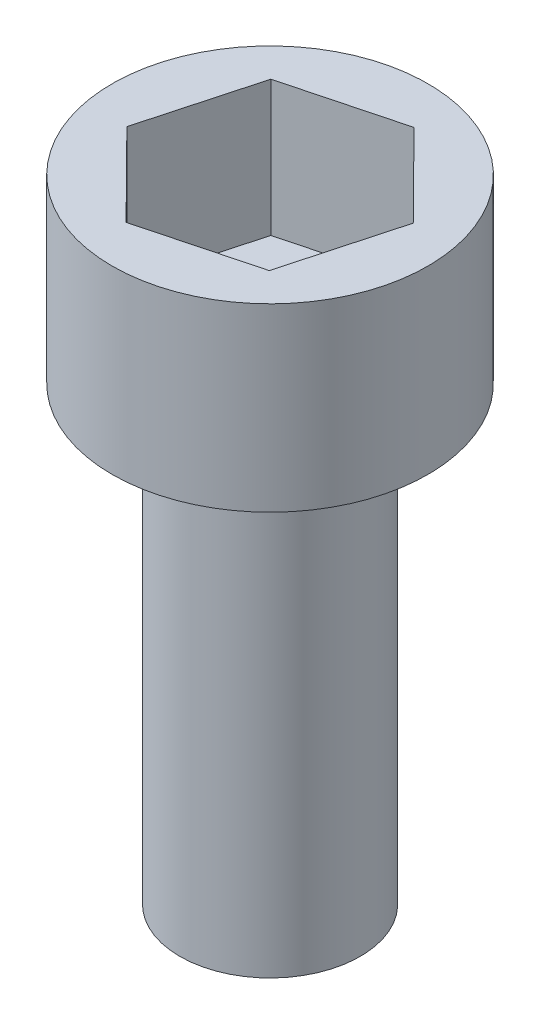
ISO-10303-21;
HEADER;
FILE_DESCRIPTION(('STEP AP214'),'2;1');
FILE_NAME('part.step','',(''),(''),'','','');
FILE_SCHEMA(('AUTOMOTIVE_DESIGN { 1 0 10303 214 1 1 1 1 }'));
ENDSEC;
DATA;
#1=APPLICATION_CONTEXT('core data for automotive mechanical design processes');
#2=APPLICATION_PROTOCOL_DEFINITION('international standard','automotive_design',2000,#1);
#3=PRODUCT_CONTEXT('',#1,'mechanical');
#4=PRODUCT('Part','Part','',(#3));
#5=PRODUCT_RELATED_PRODUCT_CATEGORY('part','',(#4));
#6=PRODUCT_DEFINITION_FORMATION('','',#4);
#7=PRODUCT_DEFINITION_CONTEXT('part definition',#1,'design');
#8=PRODUCT_DEFINITION('design','',#6,#7);
#9=PRODUCT_DEFINITION_SHAPE('','',#8);
#10=(LENGTH_UNIT() NAMED_UNIT(*) SI_UNIT(.MILLI.,.METRE.));
#11=(NAMED_UNIT(*) PLANE_ANGLE_UNIT() SI_UNIT($,.RADIAN.));
#12=(NAMED_UNIT(*) SI_UNIT($,.STERADIAN.) SOLID_ANGLE_UNIT());
#13=UNCERTAINTY_MEASURE_WITH_UNIT(LENGTH_MEASURE(1.E-05),#10,'distance_accuracy_value','');
#14=(GEOMETRIC_REPRESENTATION_CONTEXT(3) GLOBAL_UNCERTAINTY_ASSIGNED_CONTEXT((#13)) GLOBAL_UNIT_ASSIGNED_CONTEXT((#10,
#11,#12)) REPRESENTATION_CONTEXT('',''));
#15=CARTESIAN_POINT('',(0.,0.,0.));
#16=DIRECTION('',(0.,0.,1.));
#17=DIRECTION('',(1.,0.,0.));
#18=AXIS2_PLACEMENT_3D('',#15,#16,#17);
#19=CARTESIAN_POINT('',(0.,10.,0.));
#20=DIRECTION('',(0.,-1.,0.));
#21=DIRECTION('',(0.,0.,-1.));
#22=AXIS2_PLACEMENT_3D('',#19,#20,#21);
#23=CYLINDRICAL_SURFACE('',#22,2.);
#24=CARTESIAN_POINT('',(0.,10.,0.));
#25=DIRECTION('',(0.,1.,0.));
#26=DIRECTION('',(0.,0.,1.));
#27=AXIS2_PLACEMENT_3D('',#24,#25,#26);
#28=CIRCLE('',#27,2.);
#29=CARTESIAN_POINT('',(0.,10.,2.));
#30=VERTEX_POINT('',#29);
#31=EDGE_CURVE('E11',#30,#30,#28,.T.);
#32=ORIENTED_EDGE('',*,*,#31,.F.);
#33=EDGE_LOOP('',(#32));
#34=FACE_BOUND('',#33,.T.);
#35=CARTESIAN_POINT('',(0.,0.,0.));
#36=DIRECTION('',(0.,1.,0.));
#37=DIRECTION('',(0.,0.,1.));
#38=AXIS2_PLACEMENT_3D('',#35,#36,#37);
#39=CIRCLE('',#38,2.);
#40=CARTESIAN_POINT('',(0.,0.,2.));
#41=VERTEX_POINT('',#40);
#42=EDGE_CURVE('E42',#41,#41,#39,.T.);
#43=ORIENTED_EDGE('',*,*,#42,.T.);
#44=EDGE_LOOP('',(#43));
#45=FACE_BOUND('',#44,.T.);
#46=ADVANCED_FACE('F39',(#34,#45),#23,.T.);
#47=CARTESIAN_POINT('',(0.,0.,0.));
#48=DIRECTION('',(0.,1.,0.));
#49=DIRECTION('',(0.,0.,1.));
#50=AXIS2_PLACEMENT_3D('',#47,#48,#49);
#51=PLANE('',#50);
#52=ORIENTED_EDGE('',*,*,#42,.F.);
#53=EDGE_LOOP('',(#52));
#54=FACE_BOUND('',#53,.T.);
#55=ADVANCED_FACE('F189',(#54),#51,.F.);
#56=CARTESIAN_POINT('',(0.,14.,0.));
#57=DIRECTION('',(0.,-1.,0.));
#58=DIRECTION('',(0.,0.,-1.));
#59=AXIS2_PLACEMENT_3D('',#56,#57,#58);
#60=CYLINDRICAL_SURFACE('',#59,3.5);
#61=CARTESIAN_POINT('',(0.,14.,0.));
#62=DIRECTION('',(0.,1.,0.));
#63=DIRECTION('',(0.,0.,1.));
#64=AXIS2_PLACEMENT_3D('',#61,#62,#63);
#65=CIRCLE('',#64,3.5);
#66=CARTESIAN_POINT('',(0.,14.,3.5));
#67=VERTEX_POINT('',#66);
#68=EDGE_CURVE('E163',#67,#67,#65,.T.);
#69=ORIENTED_EDGE('',*,*,#68,.F.);
#70=EDGE_LOOP('',(#69));
#71=FACE_BOUND('',#70,.T.);
#72=CARTESIAN_POINT('',(0.,10.,0.));
#73=DIRECTION('',(0.,1.,0.));
#74=DIRECTION('',(0.,0.,1.));
#75=AXIS2_PLACEMENT_3D('',#72,#73,#74);
#76=CIRCLE('',#75,3.5);
#77=CARTESIAN_POINT('',(0.,10.,3.5));
#78=VERTEX_POINT('',#77);
#79=EDGE_CURVE('E153',#78,#78,#76,.T.);
#80=ORIENTED_EDGE('',*,*,#79,.T.);
#81=EDGE_LOOP('',(#80));
#82=FACE_BOUND('',#81,.T.);
#83=ADVANCED_FACE('F171',(#71,#82),#60,.T.);
#84=CARTESIAN_POINT('',(0.,14.,0.));
#85=DIRECTION('',(0.,1.,0.));
#86=DIRECTION('',(0.,0.,1.));
#87=AXIS2_PLACEMENT_3D('',#84,#85,#86);
#88=PLANE('',#87);
#89=DIRECTION('',(0.263358332480012,0.,-0.964698081636606));
#90=VECTOR('',#89,1.);
#91=CARTESIAN_POINT('',(1.82845817434336,14.,1.84573581659914));
#92=LINE('',#91,#90);
#93=CARTESIAN_POINT('',(1.82845817434336,14.,1.84573581659914));
#94=VERTEX_POINT('',#93);
#95=CARTESIAN_POINT('',(2.51268319302135,14.,-0.660623320439094));
#96=VERTEX_POINT('',#95);
#97=EDGE_CURVE('E54',#94,#96,#92,.T.);
#98=ORIENTED_EDGE('',*,*,#97,.F.);
#99=DIRECTION('',(0.967132211919421,0.,-0.254274034592304));
#100=VECTOR('',#99,1.);
#101=CARTESIAN_POINT('',(-0.684225018677993,14.,2.50635913703824));
#102=LINE('',#101,#100);
#103=CARTESIAN_POINT('',(-0.684225018677993,14.,2.50635913703824));
#104=VERTEX_POINT('',#103);
#105=EDGE_CURVE('E147',#104,#94,#102,.T.);
#106=ORIENTED_EDGE('',*,*,#105,.F.);
#107=DIRECTION('',(0.703773879439409,0.,0.710424047044302));
#108=VECTOR('',#107,1.);
#109=CARTESIAN_POINT('',(-2.51268319302135,14.,0.660623320439094));
#110=LINE('',#109,#108);
#111=CARTESIAN_POINT('',(-2.51268319302135,14.,0.660623320439094));
#112=VERTEX_POINT('',#111);
#113=EDGE_CURVE('E144',#112,#104,#110,.T.);
#114=ORIENTED_EDGE('',*,*,#113,.F.);
#115=DIRECTION('',(-0.263358332480012,0.,0.964698081636606));
#116=VECTOR('',#115,1.);
#117=CARTESIAN_POINT('',(-1.82845817434336,14.,-1.84573581659914));
#118=LINE('',#117,#116);
#119=CARTESIAN_POINT('',(-1.82845817434336,14.,-1.84573581659914));
#120=VERTEX_POINT('',#119);
#121=EDGE_CURVE('E102',#120,#112,#118,.T.);
#122=ORIENTED_EDGE('',*,*,#121,.F.);
#123=DIRECTION('',(-0.967132211919421,0.,0.254274034592304));
#124=VECTOR('',#123,1.);
#125=CARTESIAN_POINT('',(0.684225018677995,14.,-2.50635913703824));
#126=LINE('',#125,#124);
#127=CARTESIAN_POINT('',(0.684225018677995,14.,-2.50635913703824));
#128=VERTEX_POINT('',#127);
#129=EDGE_CURVE('E138',#128,#120,#126,.T.);
#130=ORIENTED_EDGE('',*,*,#129,.F.);
#131=DIRECTION('',(-0.703773879439409,0.,-0.710424047044302));
#132=VECTOR('',#131,1.);
#133=CARTESIAN_POINT('',(2.51268319302135,14.,-0.660623320439094));
#134=LINE('',#133,#132);
#135=EDGE_CURVE('E134',#96,#128,#134,.T.);
#136=ORIENTED_EDGE('',*,*,#135,.F.);
#137=EDGE_LOOP('',(#98,#106,#114,#122,#130,#136));
#138=FACE_BOUND('',#137,.T.);
#139=ORIENTED_EDGE('',*,*,#68,.T.);
#140=EDGE_LOOP('',(#139));
#141=FACE_BOUND('',#140,.T.);
#142=ADVANCED_FACE('F176',(#138,#141),#88,.T.);
#143=CARTESIAN_POINT('',(0.,10.,0.));
#144=DIRECTION('',(0.,1.,0.));
#145=DIRECTION('',(0.,0.,1.));
#146=AXIS2_PLACEMENT_3D('',#143,#144,#145);
#147=PLANE('',#146);
#148=ORIENTED_EDGE('',*,*,#31,.T.);
#149=EDGE_LOOP('',(#148));
#150=FACE_BOUND('',#149,.T.);
#151=ORIENTED_EDGE('',*,*,#79,.F.);
#152=EDGE_LOOP('',(#151));
#153=FACE_BOUND('',#152,.T.);
#154=ADVANCED_FACE('F173',(#150,#153),#147,.F.);
#155=CARTESIAN_POINT('',(1.82845817434336,11.,1.84573581659914));
#156=DIRECTION('',(0.964698081636606,0.,0.263358332480012));
#157=DIRECTION('',(0.263358332480012,0.,-0.964698081636606));
#158=AXIS2_PLACEMENT_3D('',#155,#156,#157);
#159=PLANE('',#158);
#160=ORIENTED_EDGE('',*,*,#97,.T.);
#161=DIRECTION('',(0.,1.,0.));
#162=VECTOR('',#161,1.);
#163=CARTESIAN_POINT('',(2.51268319302135,11.,-0.660623320439094));
#164=LINE('',#163,#162);
#165=CARTESIAN_POINT('',(2.51268319302135,11.,-0.660623320439094));
#166=VERTEX_POINT('',#165);
#167=EDGE_CURVE('E84',#166,#96,#164,.T.);
#168=ORIENTED_EDGE('',*,*,#167,.F.);
#169=DIRECTION('',(0.263358332480012,0.,-0.964698081636606));
#170=VECTOR('',#169,1.);
#171=CARTESIAN_POINT('',(1.82845817434336,11.,1.84573581659914));
#172=LINE('',#171,#170);
#173=CARTESIAN_POINT('',(1.82845817434336,11.,1.84573581659914));
#174=VERTEX_POINT('',#173);
#175=EDGE_CURVE('E150',#174,#166,#172,.T.);
#176=ORIENTED_EDGE('',*,*,#175,.F.);
#177=DIRECTION('',(0.,1.,0.));
#178=VECTOR('',#177,1.);
#179=CARTESIAN_POINT('',(1.82845817434336,11.,1.84573581659914));
#180=LINE('',#179,#178);
#181=EDGE_CURVE('E62',#174,#94,#180,.T.);
#182=ORIENTED_EDGE('',*,*,#181,.T.);
#183=EDGE_LOOP('',(#160,#168,#176,#182));
#184=FACE_BOUND('',#183,.T.);
#185=ADVANCED_FACE('F175',(#184),#159,.F.);
#186=CARTESIAN_POINT('',(-0.684225018677993,11.,2.50635913703824));
#187=DIRECTION('',(0.254274034592304,0.,0.967132211919421));
#188=DIRECTION('',(0.967132211919421,0.,-0.254274034592304));
#189=AXIS2_PLACEMENT_3D('',#186,#187,#188);
#190=PLANE('',#189);
#191=ORIENTED_EDGE('',*,*,#105,.T.);
#192=ORIENTED_EDGE('',*,*,#181,.F.);
#193=DIRECTION('',(0.967132211919421,0.,-0.254274034592304));
#194=VECTOR('',#193,1.);
#195=CARTESIAN_POINT('',(-0.684225018677993,11.,2.50635913703824));
#196=LINE('',#195,#194);
#197=CARTESIAN_POINT('',(-0.684225018677993,11.,2.50635913703824));
#198=VERTEX_POINT('',#197);
#199=EDGE_CURVE('E116',#198,#174,#196,.T.);
#200=ORIENTED_EDGE('',*,*,#199,.F.);
#201=DIRECTION('',(0.,1.,0.));
#202=VECTOR('',#201,1.);
#203=CARTESIAN_POINT('',(-0.684225018677993,11.,2.50635913703824));
#204=LINE('',#203,#202);
#205=EDGE_CURVE('E107',#198,#104,#204,.T.);
#206=ORIENTED_EDGE('',*,*,#205,.T.);
#207=EDGE_LOOP('',(#191,#192,#200,#206));
#208=FACE_BOUND('',#207,.T.);
#209=ADVANCED_FACE('F183',(#208),#190,.F.);
#210=CARTESIAN_POINT('',(-2.51268319302135,11.,0.660623320439094));
#211=DIRECTION('',(-0.710424047044302,0.,0.703773879439409));
#212=DIRECTION('',(0.703773879439409,0.,0.710424047044302));
#213=AXIS2_PLACEMENT_3D('',#210,#211,#212);
#214=PLANE('',#213);
#215=ORIENTED_EDGE('',*,*,#113,.T.);
#216=ORIENTED_EDGE('',*,*,#205,.F.);
#217=DIRECTION('',(0.703773879439409,0.,0.710424047044302));
#218=VECTOR('',#217,1.);
#219=CARTESIAN_POINT('',(-2.51268319302135,11.,0.660623320439094));
#220=LINE('',#219,#218);
#221=CARTESIAN_POINT('',(-2.51268319302135,11.,0.660623320439094));
#222=VERTEX_POINT('',#221);
#223=EDGE_CURVE('E111',#222,#198,#220,.T.);
#224=ORIENTED_EDGE('',*,*,#223,.F.);
#225=DIRECTION('',(0.,1.,0.));
#226=VECTOR('',#225,1.);
#227=CARTESIAN_POINT('',(-2.51268319302135,11.,0.660623320439094));
#228=LINE('',#227,#226);
#229=EDGE_CURVE('E95',#222,#112,#228,.T.);
#230=ORIENTED_EDGE('',*,*,#229,.T.);
#231=EDGE_LOOP('',(#215,#216,#224,#230));
#232=FACE_BOUND('',#231,.T.);
#233=ADVANCED_FACE('F112',(#232),#214,.F.);
#234=CARTESIAN_POINT('',(-1.82845817434336,11.,-1.84573581659914));
#235=DIRECTION('',(-0.964698081636606,0.,-0.263358332480012));
#236=DIRECTION('',(-0.263358332480012,0.,0.964698081636606));
#237=AXIS2_PLACEMENT_3D('',#234,#235,#236);
#238=PLANE('',#237);
#239=ORIENTED_EDGE('',*,*,#121,.T.);
#240=ORIENTED_EDGE('',*,*,#229,.F.);
#241=DIRECTION('',(-0.263358332480012,0.,0.964698081636606));
#242=VECTOR('',#241,1.);
#243=CARTESIAN_POINT('',(-1.82845817434336,11.,-1.84573581659914));
#244=LINE('',#243,#242);
#245=CARTESIAN_POINT('',(-1.82845817434336,11.,-1.84573581659914));
#246=VERTEX_POINT('',#245);
#247=EDGE_CURVE('E99',#246,#222,#244,.T.);
#248=ORIENTED_EDGE('',*,*,#247,.F.);
#249=DIRECTION('',(0.,1.,0.));
#250=VECTOR('',#249,1.);
#251=CARTESIAN_POINT('',(-1.82845817434336,11.,-1.84573581659914));
#252=LINE('',#251,#250);
#253=EDGE_CURVE('E108',#246,#120,#252,.T.);
#254=ORIENTED_EDGE('',*,*,#253,.T.);
#255=EDGE_LOOP('',(#239,#240,#248,#254));
#256=FACE_BOUND('',#255,.T.);
#257=ADVANCED_FACE('F97',(#256),#238,.F.);
#258=CARTESIAN_POINT('',(0.684225018677995,11.,-2.50635913703824));
#259=DIRECTION('',(-0.254274034592304,0.,-0.967132211919421));
#260=DIRECTION('',(-0.967132211919421,0.,0.254274034592304));
#261=AXIS2_PLACEMENT_3D('',#258,#259,#260);
#262=PLANE('',#261);
#263=ORIENTED_EDGE('',*,*,#129,.T.);
#264=ORIENTED_EDGE('',*,*,#253,.F.);
#265=DIRECTION('',(-0.967132211919421,0.,0.254274034592304));
#266=VECTOR('',#265,1.);
#267=CARTESIAN_POINT('',(0.684225018677995,11.,-2.50635913703824));
#268=LINE('',#267,#266);
#269=CARTESIAN_POINT('',(0.684225018677995,11.,-2.50635913703824));
#270=VERTEX_POINT('',#269);
#271=EDGE_CURVE('E122',#270,#246,#268,.T.);
#272=ORIENTED_EDGE('',*,*,#271,.F.);
#273=DIRECTION('',(0.,1.,0.));
#274=VECTOR('',#273,1.);
#275=CARTESIAN_POINT('',(0.684225018677995,11.,-2.50635913703824));
#276=LINE('',#275,#274);
#277=EDGE_CURVE('E158',#270,#128,#276,.T.);
#278=ORIENTED_EDGE('',*,*,#277,.T.);
#279=EDGE_LOOP('',(#263,#264,#272,#278));
#280=FACE_BOUND('',#279,.T.);
#281=ADVANCED_FACE('F245',(#280),#262,.F.);
#282=CARTESIAN_POINT('',(2.51268319302135,11.,-0.660623320439094));
#283=DIRECTION('',(0.710424047044302,0.,-0.703773879439409));
#284=DIRECTION('',(-0.703773879439409,0.,-0.710424047044302));
#285=AXIS2_PLACEMENT_3D('',#282,#283,#284);
#286=PLANE('',#285);
#287=ORIENTED_EDGE('',*,*,#135,.T.);
#288=ORIENTED_EDGE('',*,*,#277,.F.);
#289=DIRECTION('',(-0.703773879439409,0.,-0.710424047044302));
#290=VECTOR('',#289,1.);
#291=CARTESIAN_POINT('',(2.51268319302135,11.,-0.660623320439094));
#292=LINE('',#291,#290);
#293=EDGE_CURVE('E126',#166,#270,#292,.T.);
#294=ORIENTED_EDGE('',*,*,#293,.F.);
#295=ORIENTED_EDGE('',*,*,#167,.T.);
#296=EDGE_LOOP('',(#287,#288,#294,#295));
#297=FACE_BOUND('',#296,.T.);
#298=ADVANCED_FACE('F254',(#297),#286,.F.);
#299=CARTESIAN_POINT('',(0.,11.,0.));
#300=DIRECTION('',(0.,1.,0.));
#301=DIRECTION('',(0.,0.,1.));
#302=AXIS2_PLACEMENT_3D('',#299,#300,#301);
#303=PLANE('',#302);
#304=ORIENTED_EDGE('',*,*,#175,.T.);
#305=ORIENTED_EDGE('',*,*,#293,.T.);
#306=ORIENTED_EDGE('',*,*,#271,.T.);
#307=ORIENTED_EDGE('',*,*,#247,.T.);
#308=ORIENTED_EDGE('',*,*,#223,.T.);
#309=ORIENTED_EDGE('',*,*,#199,.T.);
#310=EDGE_LOOP('',(#304,#305,#306,#307,#308,#309));
#311=FACE_BOUND('',#310,.T.);
#312=ADVANCED_FACE('F119',(#311),#303,.T.);
#313=CLOSED_SHELL('',(#46,#55,#83,#142,#154,#185,#209,#233,#257,#281,#298,#312));
#314=MANIFOLD_SOLID_BREP('B2',#313);
#315=ADVANCED_BREP_SHAPE_REPRESENTATION('',(#18,#314),#14);
#316=SHAPE_DEFINITION_REPRESENTATION(#9,#315);
ENDSEC;
END-ISO-10303-21;
